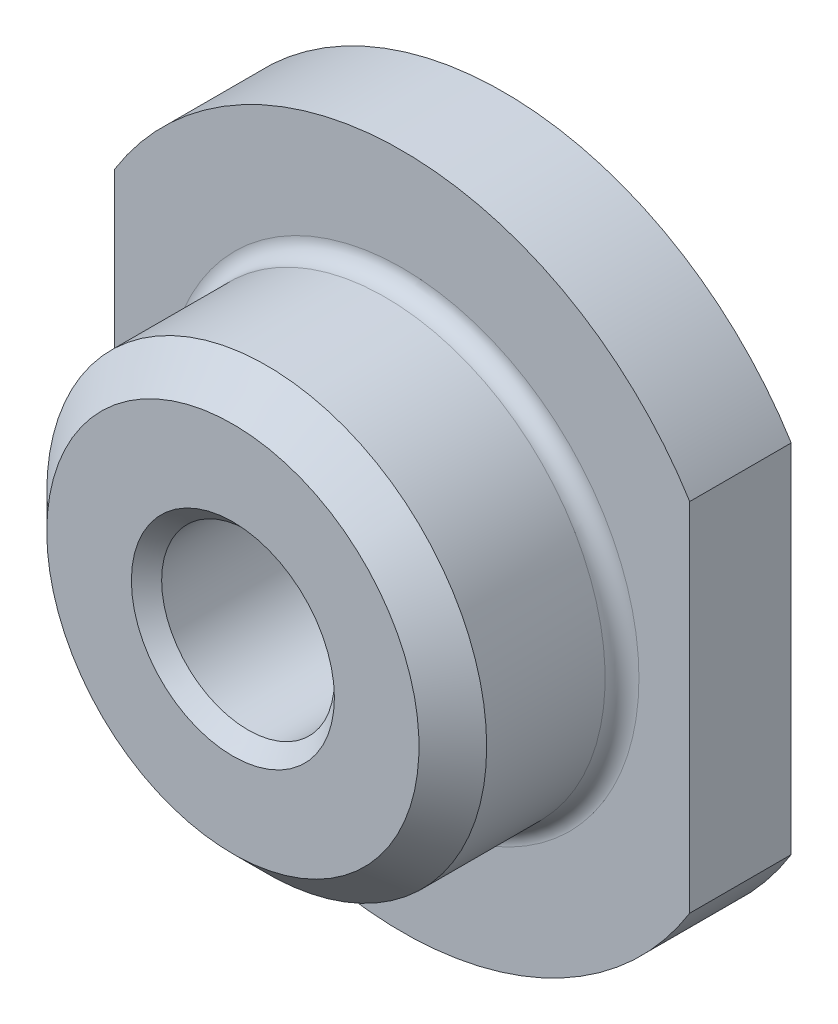
ISO-10303-21;
HEADER;
FILE_DESCRIPTION(('STEP AP214'),'2;1');
FILE_NAME('part.step','',(''),(''),'','','');
FILE_SCHEMA(('AUTOMOTIVE_DESIGN { 1 0 10303 214 1 1 1 1 }'));
ENDSEC;
DATA;
#1=APPLICATION_CONTEXT('core data for automotive mechanical design processes');
#2=APPLICATION_PROTOCOL_DEFINITION('international standard','automotive_design',2000,#1);
#3=PRODUCT_CONTEXT('',#1,'mechanical');
#4=PRODUCT('Part','Part','',(#3));
#5=PRODUCT_RELATED_PRODUCT_CATEGORY('part','',(#4));
#6=PRODUCT_DEFINITION_FORMATION('','',#4);
#7=PRODUCT_DEFINITION_CONTEXT('part definition',#1,'design');
#8=PRODUCT_DEFINITION('design','',#6,#7);
#9=PRODUCT_DEFINITION_SHAPE('','',#8);
#10=(LENGTH_UNIT() NAMED_UNIT(*) SI_UNIT(.MILLI.,.METRE.));
#11=(NAMED_UNIT(*) PLANE_ANGLE_UNIT() SI_UNIT($,.RADIAN.));
#12=(NAMED_UNIT(*) SI_UNIT($,.STERADIAN.) SOLID_ANGLE_UNIT());
#13=UNCERTAINTY_MEASURE_WITH_UNIT(LENGTH_MEASURE(1.E-05),#10,'distance_accuracy_value','');
#14=(GEOMETRIC_REPRESENTATION_CONTEXT(3) GLOBAL_UNCERTAINTY_ASSIGNED_CONTEXT((#13)) GLOBAL_UNIT_ASSIGNED_CONTEXT((#10,
#11,#12)) REPRESENTATION_CONTEXT('',''));
#15=CARTESIAN_POINT('',(0.,0.,0.));
#16=DIRECTION('',(0.,0.,1.));
#17=DIRECTION('',(1.,0.,0.));
#18=AXIS2_PLACEMENT_3D('',#15,#16,#17);
#19=CARTESIAN_POINT('',(0.,0.,7.000000000005));
#20=DIRECTION('',(0.,0.,-1.));
#21=DIRECTION('',(-1.,0.,0.));
#22=AXIS2_PLACEMENT_3D('',#19,#20,#21);
#23=CONICAL_SURFACE('',#22,6.50000000001683,0.785398163397448);
#24=CARTESIAN_POINT('',(0.,0.,7.00000000000001));
#25=DIRECTION('',(0.,0.,1.));
#26=DIRECTION('',(1.,0.,0.));
#27=AXIS2_PLACEMENT_3D('',#24,#25,#26);
#28=CIRCLE('',#27,6.5);
#29=CARTESIAN_POINT('',(6.5,0.,7.00000000000001));
#30=VERTEX_POINT('',#29);
#31=EDGE_CURVE('E147',#30,#30,#28,.F.);
#32=ORIENTED_EDGE('',*,*,#31,.F.);
#33=EDGE_LOOP('',(#32));
#34=FACE_BOUND('',#33,.T.);
#35=CARTESIAN_POINT('',(0.,0.,7.99999999998136));
#36=DIRECTION('',(0.,0.,-1.));
#37=DIRECTION('',(-1.,0.,0.));
#38=AXIS2_PLACEMENT_3D('',#35,#36,#37);
#39=CIRCLE('',#38,5.50000000004047);
#40=CARTESIAN_POINT('',(-5.50000000004047,0.,7.99999999998136));
#41=VERTEX_POINT('',#40);
#42=EDGE_CURVE('E140',#41,#41,#39,.F.);
#43=ORIENTED_EDGE('',*,*,#42,.F.);
#44=EDGE_LOOP('',(#43));
#45=FACE_BOUND('',#44,.T.);
#46=ADVANCED_FACE('F36',(#34,#45),#23,.T.);
#47=CARTESIAN_POINT('',(0.,0.,0.));
#48=DIRECTION('',(0.,0.,1.));
#49=DIRECTION('',(1.,0.,0.));
#50=AXIS2_PLACEMENT_3D('',#47,#48,#49);
#51=CYLINDRICAL_SURFACE('',#50,6.5);
#52=CARTESIAN_POINT('',(0.,0.,3.5));
#53=DIRECTION('',(0.,0.,-1.));
#54=DIRECTION('',(-1.,0.,0.));
#55=AXIS2_PLACEMENT_3D('',#52,#53,#54);
#56=CIRCLE('',#55,6.5);
#57=CARTESIAN_POINT('',(-6.5,0.,3.5));
#58=VERTEX_POINT('',#57);
#59=EDGE_CURVE('E136',#58,#58,#56,.F.);
#60=ORIENTED_EDGE('',*,*,#59,.T.);
#61=EDGE_LOOP('',(#60));
#62=FACE_BOUND('',#61,.T.);
#63=ORIENTED_EDGE('',*,*,#31,.T.);
#64=EDGE_LOOP('',(#63));
#65=FACE_BOUND('',#64,.T.);
#66=ADVANCED_FACE('F172',(#62,#65),#51,.T.);
#67=CARTESIAN_POINT('',(0.,5.5,7.99999999999998));
#68=DIRECTION('',(0.,0.,1.));
#69=DIRECTION('',(1.,0.,0.));
#70=AXIS2_PLACEMENT_3D('',#67,#68,#69);
#71=PLANE('',#70);
#72=ORIENTED_EDGE('',*,*,#42,.T.);
#73=EDGE_LOOP('',(#72));
#74=FACE_BOUND('',#73,.T.);
#75=CARTESIAN_POINT('',(0.,0.,7.99999999992451));
#76=DIRECTION('',(0.,0.,1.));
#77=DIRECTION('',(1.,0.,0.));
#78=AXIS2_PLACEMENT_3D('',#75,#76,#77);
#79=CIRCLE('',#78,3.00000000004275);
#80=CARTESIAN_POINT('',(3.00000000004275,0.,7.99999999992451));
#81=VERTEX_POINT('',#80);
#82=EDGE_CURVE('E139',#81,#81,#79,.F.);
#83=ORIENTED_EDGE('',*,*,#82,.T.);
#84=EDGE_LOOP('',(#83));
#85=FACE_BOUND('',#84,.T.);
#86=ADVANCED_FACE('F131',(#74,#85),#71,.T.);
#87=CARTESIAN_POINT('',(0.,0.,3.5));
#88=DIRECTION('',(0.,0.,-1.));
#89=DIRECTION('',(-1.,0.,0.));
#90=AXIS2_PLACEMENT_3D('',#87,#88,#89);
#91=TOROIDAL_SURFACE('',#90,7.,0.499999999999999);
#92=ORIENTED_EDGE('',*,*,#59,.F.);
#93=EDGE_LOOP('',(#92));
#94=FACE_BOUND('',#93,.T.);
#95=CARTESIAN_POINT('',(0.,0.,3.));
#96=DIRECTION('',(0.,0.,1.));
#97=DIRECTION('',(-1.,0.,0.));
#98=AXIS2_PLACEMENT_3D('',#95,#96,#97);
#99=CIRCLE('',#98,7.);
#100=CARTESIAN_POINT('',(-7.,0.,3.));
#101=VERTEX_POINT('',#100);
#102=EDGE_CURVE('E104',#101,#101,#99,.F.);
#103=ORIENTED_EDGE('',*,*,#102,.F.);
#104=EDGE_LOOP('',(#103));
#105=FACE_BOUND('',#104,.T.);
#106=ADVANCED_FACE('F126',(#94,#105),#91,.F.);
#107=CARTESIAN_POINT('',(0.,0.,7.99999999986767));
#108=DIRECTION('',(0.,0.,1.));
#109=DIRECTION('',(1.,0.,0.));
#110=AXIS2_PLACEMENT_3D('',#107,#108,#109);
#111=CONICAL_SURFACE('',#110,2.9999999999859,0.785398163449935);
#112=CARTESIAN_POINT('',(0.,0.,7.55269999992872));
#113=DIRECTION('',(0.,0.,1.));
#114=DIRECTION('',(1.,0.,0.));
#115=AXIS2_PLACEMENT_3D('',#112,#113,#114);
#116=CIRCLE('',#115,2.5527);
#117=CARTESIAN_POINT('',(2.5527,0.,7.55269999992872));
#118=VERTEX_POINT('',#117);
#119=EDGE_CURVE('E155',#118,#118,#116,.F.);
#120=ORIENTED_EDGE('',*,*,#119,.T.);
#121=EDGE_LOOP('',(#120));
#122=FACE_BOUND('',#121,.T.);
#123=ORIENTED_EDGE('',*,*,#82,.F.);
#124=EDGE_LOOP('',(#123));
#125=FACE_BOUND('',#124,.T.);
#126=ADVANCED_FACE('F122',(#122,#125),#111,.F.);
#127=CARTESIAN_POINT('',(0.,9.99999999999999,3.));
#128=DIRECTION('',(0.,0.,1.));
#129=DIRECTION('',(1.,0.,0.));
#130=AXIS2_PLACEMENT_3D('',#127,#128,#129);
#131=PLANE('',#130);
#132=DIRECTION('',(0.,1.,0.));
#133=VECTOR('',#132,1.);
#134=CARTESIAN_POINT('',(-8.5,5.26782687642637,3.));
#135=LINE('',#134,#133);
#136=CARTESIAN_POINT('',(-8.5,5.26782687642637,3.));
#137=VERTEX_POINT('',#136);
#138=CARTESIAN_POINT('',(-8.5,-5.26782687642637,3.));
#139=VERTEX_POINT('',#138);
#140=EDGE_CURVE('E73',#137,#139,#135,.F.);
#141=ORIENTED_EDGE('',*,*,#140,.T.);
#142=CARTESIAN_POINT('',(0.,0.,3.));
#143=DIRECTION('',(0.,0.,1.));
#144=DIRECTION('',(1.,0.,0.));
#145=AXIS2_PLACEMENT_3D('',#142,#143,#144);
#146=CIRCLE('',#145,10.);
#147=CARTESIAN_POINT('',(8.49999999999999,-5.26782687642638,3.));
#148=VERTEX_POINT('',#147);
#149=EDGE_CURVE('E92',#148,#139,#146,.F.);
#150=ORIENTED_EDGE('',*,*,#149,.F.);
#151=DIRECTION('',(0.,1.,0.));
#152=VECTOR('',#151,1.);
#153=CARTESIAN_POINT('',(8.49999999999999,-5.26782687642637,3.));
#154=LINE('',#153,#152);
#155=CARTESIAN_POINT('',(8.5,5.26782687642637,3.));
#156=VERTEX_POINT('',#155);
#157=EDGE_CURVE('E88',#148,#156,#154,.T.);
#158=ORIENTED_EDGE('',*,*,#157,.T.);
#159=CARTESIAN_POINT('',(0.,0.,3.));
#160=DIRECTION('',(0.,0.,1.));
#161=DIRECTION('',(1.,0.,0.));
#162=AXIS2_PLACEMENT_3D('',#159,#160,#161);
#163=CIRCLE('',#162,10.);
#164=EDGE_CURVE('E78',#137,#156,#163,.F.);
#165=ORIENTED_EDGE('',*,*,#164,.F.);
#166=EDGE_LOOP('',(#141,#150,#158,#165));
#167=FACE_BOUND('',#166,.T.);
#168=ORIENTED_EDGE('',*,*,#102,.T.);
#169=EDGE_LOOP('',(#168));
#170=FACE_BOUND('',#169,.T.);
#171=ADVANCED_FACE('F89',(#167,#170),#131,.T.);
#172=CARTESIAN_POINT('',(-8.5,5.26782687642637,3.5));
#173=DIRECTION('',(1.,0.,0.));
#174=DIRECTION('',(0.,0.,-1.));
#175=AXIS2_PLACEMENT_3D('',#172,#173,#174);
#176=PLANE('',#175);
#177=DIRECTION('',(0.,0.,1.));
#178=VECTOR('',#177,1.);
#179=CARTESIAN_POINT('',(-8.5,5.26782687642637,0.));
#180=LINE('',#179,#178);
#181=CARTESIAN_POINT('',(-8.5,5.26782687642637,0.));
#182=VERTEX_POINT('',#181);
#183=EDGE_CURVE('E84',#182,#137,#180,.T.);
#184=ORIENTED_EDGE('',*,*,#183,.F.);
#185=DIRECTION('',(0.,1.,0.));
#186=VECTOR('',#185,1.);
#187=CARTESIAN_POINT('',(-8.49999999999999,3.,0.));
#188=LINE('',#187,#186);
#189=CARTESIAN_POINT('',(-8.5,-5.26782687642637,0.));
#190=VERTEX_POINT('',#189);
#191=EDGE_CURVE('E162',#190,#182,#188,.T.);
#192=ORIENTED_EDGE('',*,*,#191,.F.);
#193=DIRECTION('',(0.,0.,1.));
#194=VECTOR('',#193,1.);
#195=CARTESIAN_POINT('',(-8.5,-5.26782687642637,0.));
#196=LINE('',#195,#194);
#197=EDGE_CURVE('E163',#139,#190,#196,.F.);
#198=ORIENTED_EDGE('',*,*,#197,.F.);
#199=ORIENTED_EDGE('',*,*,#140,.F.);
#200=EDGE_LOOP('',(#184,#192,#198,#199));
#201=FACE_BOUND('',#200,.T.);
#202=ADVANCED_FACE('F121',(#201),#176,.F.);
#203=CARTESIAN_POINT('',(0.,0.,0.));
#204=DIRECTION('',(0.,0.,1.));
#205=DIRECTION('',(1.,0.,0.));
#206=AXIS2_PLACEMENT_3D('',#203,#204,#205);
#207=CYLINDRICAL_SURFACE('',#206,10.);
#208=DIRECTION('',(0.,0.,1.));
#209=VECTOR('',#208,1.);
#210=CARTESIAN_POINT('',(8.5,5.26782687642637,3.5));
#211=LINE('',#210,#209);
#212=CARTESIAN_POINT('',(8.5,5.26782687642637,0.));
#213=VERTEX_POINT('',#212);
#214=EDGE_CURVE('E83',#156,#213,#211,.F.);
#215=ORIENTED_EDGE('',*,*,#214,.T.);
#216=CARTESIAN_POINT('',(0.,0.,0.));
#217=DIRECTION('',(0.,0.,1.));
#218=DIRECTION('',(1.,0.,0.));
#219=AXIS2_PLACEMENT_3D('',#216,#217,#218);
#220=CIRCLE('',#219,10.);
#221=EDGE_CURVE('E160',#182,#213,#220,.F.);
#222=ORIENTED_EDGE('',*,*,#221,.F.);
#223=ORIENTED_EDGE('',*,*,#183,.T.);
#224=ORIENTED_EDGE('',*,*,#164,.T.);
#225=EDGE_LOOP('',(#215,#222,#223,#224));
#226=FACE_BOUND('',#225,.T.);
#227=ADVANCED_FACE('F80',(#226),#207,.T.);
#228=CARTESIAN_POINT('',(8.5,-5.26782687642637,3.5));
#229=DIRECTION('',(-1.,0.,0.));
#230=DIRECTION('',(0.,0.,1.));
#231=AXIS2_PLACEMENT_3D('',#228,#229,#230);
#232=PLANE('',#231);
#233=DIRECTION('',(0.,0.,1.));
#234=VECTOR('',#233,1.);
#235=CARTESIAN_POINT('',(8.49999999999999,-5.26782687642637,0.));
#236=LINE('',#235,#234);
#237=CARTESIAN_POINT('',(8.49999999999999,-5.26782687642638,0.));
#238=VERTEX_POINT('',#237);
#239=EDGE_CURVE('E54',#238,#148,#236,.T.);
#240=ORIENTED_EDGE('',*,*,#239,.F.);
#241=DIRECTION('',(0.,1.,0.));
#242=VECTOR('',#241,1.);
#243=CARTESIAN_POINT('',(8.5,3.,0.));
#244=LINE('',#243,#242);
#245=EDGE_CURVE('E96',#213,#238,#244,.F.);
#246=ORIENTED_EDGE('',*,*,#245,.F.);
#247=ORIENTED_EDGE('',*,*,#214,.F.);
#248=ORIENTED_EDGE('',*,*,#157,.F.);
#249=EDGE_LOOP('',(#240,#246,#247,#248));
#250=FACE_BOUND('',#249,.T.);
#251=ADVANCED_FACE('F94',(#250),#232,.F.);
#252=CARTESIAN_POINT('',(0.,0.,0.));
#253=DIRECTION('',(0.,0.,1.));
#254=DIRECTION('',(1.,0.,0.));
#255=AXIS2_PLACEMENT_3D('',#252,#253,#254);
#256=CYLINDRICAL_SURFACE('',#255,10.);
#257=ORIENTED_EDGE('',*,*,#197,.T.);
#258=CARTESIAN_POINT('',(0.,0.,0.));
#259=DIRECTION('',(0.,0.,1.));
#260=DIRECTION('',(1.,0.,0.));
#261=AXIS2_PLACEMENT_3D('',#258,#259,#260);
#262=CIRCLE('',#261,10.);
#263=EDGE_CURVE('E45',#238,#190,#262,.F.);
#264=ORIENTED_EDGE('',*,*,#263,.F.);
#265=ORIENTED_EDGE('',*,*,#239,.T.);
#266=ORIENTED_EDGE('',*,*,#149,.T.);
#267=EDGE_LOOP('',(#257,#264,#265,#266));
#268=FACE_BOUND('',#267,.T.);
#269=ADVANCED_FACE('F191',(#268),#256,.T.);
#270=CARTESIAN_POINT('',(0.,0.,1.13686837721616E-10));
#271=DIRECTION('',(0.,0.,-1.));
#272=DIRECTION('',(-1.,0.,0.));
#273=AXIS2_PLACEMENT_3D('',#270,#271,#272);
#274=CONICAL_SURFACE('',#273,2.99999999987222,0.785398163397448);
#275=CARTESIAN_POINT('',(0.,0.,0.447299999985912));
#276=DIRECTION('',(0.,0.,-1.));
#277=DIRECTION('',(-1.,0.,0.));
#278=AXIS2_PLACEMENT_3D('',#275,#276,#277);
#279=CIRCLE('',#278,2.5527);
#280=CARTESIAN_POINT('',(-2.5527,0.,0.447299999985912));
#281=VERTEX_POINT('',#280);
#282=EDGE_CURVE('E39',#281,#281,#279,.F.);
#283=ORIENTED_EDGE('',*,*,#282,.T.);
#284=EDGE_LOOP('',(#283));
#285=FACE_BOUND('',#284,.T.);
#286=CARTESIAN_POINT('',(0.,0.,0.));
#287=DIRECTION('',(0.,0.,-1.));
#288=DIRECTION('',(-1.,0.,0.));
#289=AXIS2_PLACEMENT_3D('',#286,#287,#288);
#290=CIRCLE('',#289,2.9999999999859);
#291=CARTESIAN_POINT('',(-2.9999999999859,0.,0.));
#292=VERTEX_POINT('',#291);
#293=EDGE_CURVE('E11',#292,#292,#290,.F.);
#294=ORIENTED_EDGE('',*,*,#293,.F.);
#295=EDGE_LOOP('',(#294));
#296=FACE_BOUND('',#295,.T.);
#297=ADVANCED_FACE('F185',(#285,#296),#274,.F.);
#298=CARTESIAN_POINT('',(0.,3.,0.));
#299=DIRECTION('',(0.,0.,-1.));
#300=DIRECTION('',(-1.,0.,0.));
#301=AXIS2_PLACEMENT_3D('',#298,#299,#300);
#302=PLANE('',#301);
#303=ORIENTED_EDGE('',*,*,#293,.T.);
#304=EDGE_LOOP('',(#303));
#305=FACE_BOUND('',#304,.T.);
#306=ORIENTED_EDGE('',*,*,#245,.T.);
#307=ORIENTED_EDGE('',*,*,#263,.T.);
#308=ORIENTED_EDGE('',*,*,#191,.T.);
#309=ORIENTED_EDGE('',*,*,#221,.T.);
#310=EDGE_LOOP('',(#306,#307,#308,#309));
#311=FACE_BOUND('',#310,.T.);
#312=ADVANCED_FACE('F181',(#305,#311),#302,.T.);
#313=CARTESIAN_POINT('',(0.,0.,0.));
#314=DIRECTION('',(0.,0.,-1.));
#315=DIRECTION('',(-1.,0.,0.));
#316=AXIS2_PLACEMENT_3D('',#313,#314,#315);
#317=CYLINDRICAL_SURFACE('',#316,2.5527);
#318=ORIENTED_EDGE('',*,*,#282,.F.);
#319=EDGE_LOOP('',(#318));
#320=FACE_BOUND('',#319,.T.);
#321=ORIENTED_EDGE('',*,*,#119,.F.);
#322=EDGE_LOOP('',(#321));
#323=FACE_BOUND('',#322,.T.);
#324=ADVANCED_FACE('F174',(#320,#323),#317,.F.);
#325=CLOSED_SHELL('',(#46,#66,#86,#106,#126,#171,#202,#227,#251,#269,#297,#312,#324));
#326=MANIFOLD_SOLID_BREP('B2',#325);
#327=ADVANCED_BREP_SHAPE_REPRESENTATION('',(#18,#326),#14);
#328=SHAPE_DEFINITION_REPRESENTATION(#9,#327);
ENDSEC;
END-ISO-10303-21;
